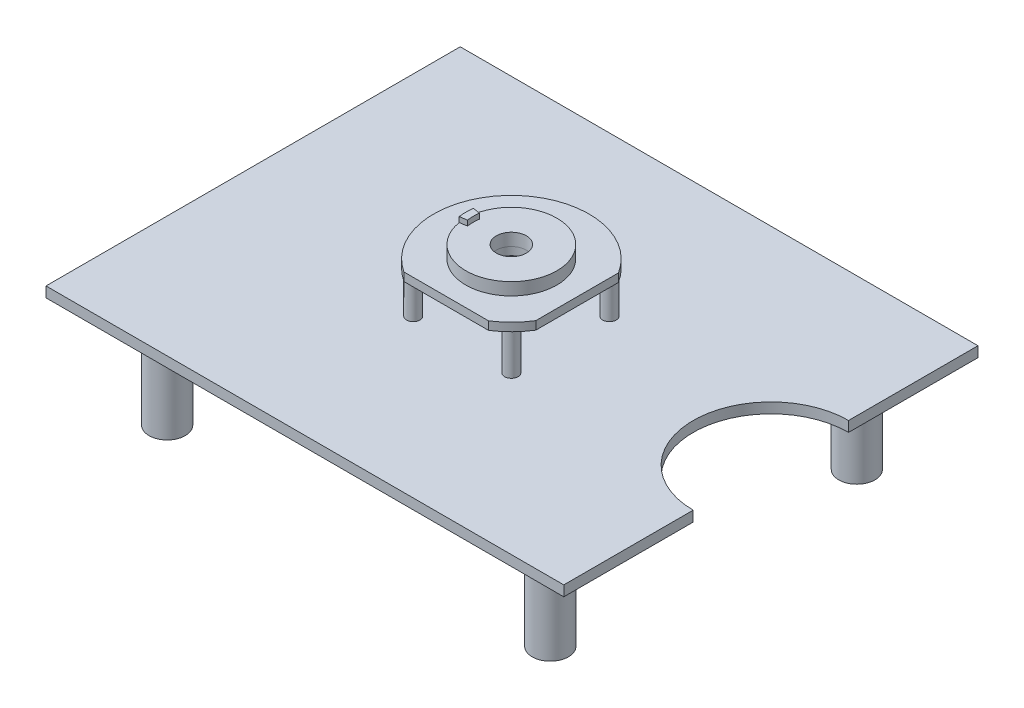
ISO-10303-21;
HEADER;
FILE_DESCRIPTION(('STEP AP214'),'2;1');
FILE_NAME('part.step','',(''),(''),'','','');
FILE_SCHEMA(('AUTOMOTIVE_DESIGN { 1 0 10303 214 1 1 1 1 }'));
ENDSEC;
DATA;
#1=APPLICATION_CONTEXT('core data for automotive mechanical design processes');
#2=APPLICATION_PROTOCOL_DEFINITION('international standard','automotive_design',2000,#1);
#3=PRODUCT_CONTEXT('',#1,'mechanical');
#4=PRODUCT('Part','Part','',(#3));
#5=PRODUCT_RELATED_PRODUCT_CATEGORY('part','',(#4));
#6=PRODUCT_DEFINITION_FORMATION('','',#4);
#7=PRODUCT_DEFINITION_CONTEXT('part definition',#1,'design');
#8=PRODUCT_DEFINITION('design','',#6,#7);
#9=PRODUCT_DEFINITION_SHAPE('','',#8);
#10=(LENGTH_UNIT() NAMED_UNIT(*) SI_UNIT(.MILLI.,.METRE.));
#11=(NAMED_UNIT(*) PLANE_ANGLE_UNIT() SI_UNIT($,.RADIAN.));
#12=(NAMED_UNIT(*) SI_UNIT($,.STERADIAN.) SOLID_ANGLE_UNIT());
#13=UNCERTAINTY_MEASURE_WITH_UNIT(LENGTH_MEASURE(1.E-05),#10,'distance_accuracy_value','');
#14=(GEOMETRIC_REPRESENTATION_CONTEXT(3) GLOBAL_UNCERTAINTY_ASSIGNED_CONTEXT((#13)) GLOBAL_UNIT_ASSIGNED_CONTEXT((#10,
#11,#12)) REPRESENTATION_CONTEXT('',''));
#15=CARTESIAN_POINT('',(0.,0.,0.));
#16=DIRECTION('',(0.,0.,1.));
#17=DIRECTION('',(1.,0.,0.));
#18=AXIS2_PLACEMENT_3D('',#15,#16,#17);
#19=CARTESIAN_POINT('',(250.,4.,-200.));
#20=DIRECTION('',(-1.,0.,0.));
#21=DIRECTION('',(0.,0.,1.));
#22=AXIS2_PLACEMENT_3D('',#19,#20,#21);
#23=PLANE('',#22);
#24=DIRECTION('',(0.,0.,-1.));
#25=VECTOR('',#24,1.);
#26=CARTESIAN_POINT('',(250.,0.,-200.));
#27=LINE('',#26,#25);
#28=CARTESIAN_POINT('',(250.,0.,200.));
#29=VERTEX_POINT('',#28);
#30=CARTESIAN_POINT('',(250.,0.,75.));
#31=VERTEX_POINT('',#30);
#32=EDGE_CURVE('E144',#29,#31,#27,.T.);
#33=ORIENTED_EDGE('',*,*,#32,.T.);
#34=DIRECTION('',(0.,1.,0.));
#35=VECTOR('',#34,1.);
#36=CARTESIAN_POINT('',(250.,-100.,75.));
#37=LINE('',#36,#35);
#38=CARTESIAN_POINT('',(250.,9.99999999999999,75.));
#39=VERTEX_POINT('',#38);
#40=EDGE_CURVE('E133',#31,#39,#37,.T.);
#41=ORIENTED_EDGE('',*,*,#40,.T.);
#42=DIRECTION('',(0.,0.,-1.));
#43=VECTOR('',#42,1.);
#44=CARTESIAN_POINT('',(250.,10.,200.));
#45=LINE('',#44,#43);
#46=CARTESIAN_POINT('',(250.,10.,200.));
#47=VERTEX_POINT('',#46);
#48=EDGE_CURVE('E142',#47,#39,#45,.T.);
#49=ORIENTED_EDGE('',*,*,#48,.F.);
#50=DIRECTION('',(0.,-1.,0.));
#51=VECTOR('',#50,1.);
#52=CARTESIAN_POINT('',(250.,4.,200.));
#53=LINE('',#52,#51);
#54=EDGE_CURVE('E192',#47,#29,#53,.T.);
#55=ORIENTED_EDGE('',*,*,#54,.T.);
#56=EDGE_LOOP('',(#33,#41,#49,#55));
#57=FACE_BOUND('',#56,.T.);
#58=ADVANCED_FACE('F34',(#57),#23,.F.);
#59=CARTESIAN_POINT('',(0.,50.,0.623845660501408));
#60=DIRECTION('',(0.,1.,0.));
#61=DIRECTION('',(-1.,0.,0.));
#62=AXIS2_PLACEMENT_3D('',#59,#60,#61);
#63=CYLINDRICAL_SURFACE('',#62,75.);
#64=CARTESIAN_POINT('',(0.,50.,0.623845660501408));
#65=DIRECTION('',(0.,-1.,0.));
#66=DIRECTION('',(1.,0.,0.));
#67=AXIS2_PLACEMENT_3D('',#64,#65,#66);
#68=CIRCLE('',#67,75.);
#69=CARTESIAN_POINT('',(63.5,50.,40.5331177661161));
#70=VERTEX_POINT('',#69);
#71=CARTESIAN_POINT('',(40.8850732599998,50.,63.5));
#72=VERTEX_POINT('',#71);
#73=EDGE_CURVE('E262',#70,#72,#68,.T.);
#74=ORIENTED_EDGE('',*,*,#73,.F.);
#75=DIRECTION('',(0.,1.,0.));
#76=VECTOR('',#75,1.);
#77=CARTESIAN_POINT('',(63.5,50.,40.5331177661161));
#78=LINE('',#77,#76);
#79=CARTESIAN_POINT('',(63.5,58.,40.5331177661161));
#80=VERTEX_POINT('',#79);
#81=EDGE_CURVE('E56',#70,#80,#78,.T.);
#82=ORIENTED_EDGE('',*,*,#81,.T.);
#83=CARTESIAN_POINT('',(0.,58.,0.623845660501408));
#84=DIRECTION('',(0.,-1.,0.));
#85=DIRECTION('',(1.,0.,0.));
#86=AXIS2_PLACEMENT_3D('',#83,#84,#85);
#87=CIRCLE('',#86,75.);
#88=CARTESIAN_POINT('',(40.8850732599998,58.,63.5));
#89=VERTEX_POINT('',#88);
#90=EDGE_CURVE('E261',#80,#89,#87,.T.);
#91=ORIENTED_EDGE('',*,*,#90,.T.);
#92=DIRECTION('',(0.,1.,0.));
#93=VECTOR('',#92,1.);
#94=CARTESIAN_POINT('',(40.8850732599998,50.,63.5));
#95=LINE('',#94,#93);
#96=EDGE_CURVE('E319',#89,#72,#95,.F.);
#97=ORIENTED_EDGE('',*,*,#96,.T.);
#98=EDGE_LOOP('',(#74,#82,#91,#97));
#99=FACE_BOUND('',#98,.T.);
#100=ADVANCED_FACE('F376',(#99),#63,.T.);
#101=CARTESIAN_POINT('',(14.5,58.,0.623845660501408));
#102=DIRECTION('',(0.,-1.,0.));
#103=DIRECTION('',(0.,0.,-1.));
#104=AXIS2_PLACEMENT_3D('',#101,#102,#103);
#105=PLANE('',#104);
#106=CARTESIAN_POINT('',(0.,58.,0.623845660501408));
#107=DIRECTION('',(0.,-1.,0.));
#108=DIRECTION('',(0.,0.,-1.));
#109=AXIS2_PLACEMENT_3D('',#106,#107,#108);
#110=CIRCLE('',#109,14.5);
#111=CARTESIAN_POINT('',(0.,58.,-13.8761543394986));
#112=VERTEX_POINT('',#111);
#113=EDGE_CURVE('E330',#112,#112,#110,.T.);
#114=ORIENTED_EDGE('',*,*,#113,.F.);
#115=EDGE_LOOP('',(#114));
#116=FACE_BOUND('',#115,.T.);
#117=CARTESIAN_POINT('',(0.,58.,0.623845660501408));
#118=DIRECTION('',(0.,1.,0.));
#119=DIRECTION('',(-1.,0.,0.));
#120=AXIS2_PLACEMENT_3D('',#117,#118,#119);
#121=CIRCLE('',#120,15.);
#122=CARTESIAN_POINT('',(-15.,58.,0.623845660501408));
#123=VERTEX_POINT('',#122);
#124=EDGE_CURVE('E241',#123,#123,#121,.T.);
#125=ORIENTED_EDGE('',*,*,#124,.F.);
#126=EDGE_LOOP('',(#125));
#127=FACE_BOUND('',#126,.T.);
#128=ADVANCED_FACE('F382',(#116,#127),#105,.T.);
#129=CARTESIAN_POINT('',(0.,58.,0.623845660501408));
#130=DIRECTION('',(0.,-1.,0.));
#131=DIRECTION('',(0.,0.,-1.));
#132=AXIS2_PLACEMENT_3D('',#129,#130,#131);
#133=CYLINDRICAL_SURFACE('',#132,44.);
#134=CARTESIAN_POINT('',(0.,70.,0.623845660501408));
#135=DIRECTION('',(0.,-1.,0.));
#136=DIRECTION('',(0.,0.,-1.));
#137=AXIS2_PLACEMENT_3D('',#134,#135,#136);
#138=CIRCLE('',#137,44.);
#139=CARTESIAN_POINT('',(-43.458286986186,70.,-6.25927080126876));
#140=VERTEX_POINT('',#139);
#141=CARTESIAN_POINT('',(-43.458286986186,70.,7.50696212227159));
#142=VERTEX_POINT('',#141);
#143=EDGE_CURVE('E224',#140,#142,#138,.T.);
#144=ORIENTED_EDGE('',*,*,#143,.T.);
#145=DIRECTION('',(0.,-1.,0.));
#146=VECTOR('',#145,1.);
#147=CARTESIAN_POINT('',(-43.458286986186,75.,7.50696212227159));
#148=LINE('',#147,#146);
#149=CARTESIAN_POINT('',(-43.458286986186,75.,7.50696212227159));
#150=VERTEX_POINT('',#149);
#151=EDGE_CURVE('E226',#150,#142,#148,.T.);
#152=ORIENTED_EDGE('',*,*,#151,.F.);
#153=CARTESIAN_POINT('',(0.,75.,0.623845660501408));
#154=DIRECTION('',(0.,1.,0.));
#155=DIRECTION('',(0.,0.,1.));
#156=AXIS2_PLACEMENT_3D('',#153,#154,#155);
#157=CIRCLE('',#156,44.);
#158=CARTESIAN_POINT('',(-43.458286986186,75.,-6.25927080126876));
#159=VERTEX_POINT('',#158);
#160=EDGE_CURVE('E204',#159,#150,#157,.T.);
#161=ORIENTED_EDGE('',*,*,#160,.F.);
#162=DIRECTION('',(0.,-1.,0.));
#163=VECTOR('',#162,1.);
#164=CARTESIAN_POINT('',(-43.458286986186,75.,-6.25927080126876));
#165=LINE('',#164,#163);
#166=EDGE_CURVE('E215',#159,#140,#165,.T.);
#167=ORIENTED_EDGE('',*,*,#166,.T.);
#168=EDGE_LOOP('',(#144,#152,#161,#167));
#169=FACE_BOUND('',#168,.T.);
#170=CARTESIAN_POINT('',(0.,58.,0.623845660501408));
#171=DIRECTION('',(0.,-1.,0.));
#172=DIRECTION('',(0.,0.,-1.));
#173=AXIS2_PLACEMENT_3D('',#170,#171,#172);
#174=CIRCLE('',#173,44.);
#175=CARTESIAN_POINT('',(0.,58.,-43.3761543394986));
#176=VERTEX_POINT('',#175);
#177=EDGE_CURVE('E326',#176,#176,#174,.T.);
#178=ORIENTED_EDGE('',*,*,#177,.F.);
#179=EDGE_LOOP('',(#178));
#180=FACE_BOUND('',#179,.T.);
#181=ADVANCED_FACE('F36',(#169,#180),#133,.T.);
#182=CARTESIAN_POINT('',(0.,58.,0.623845660501408));
#183=DIRECTION('',(0.,-1.,0.));
#184=DIRECTION('',(0.,0.,-1.));
#185=AXIS2_PLACEMENT_3D('',#182,#183,#184);
#186=CYLINDRICAL_SURFACE('',#185,14.5);
#187=ORIENTED_EDGE('',*,*,#113,.T.);
#188=EDGE_LOOP('',(#187));
#189=FACE_BOUND('',#188,.T.);
#190=CARTESIAN_POINT('',(0.,70.,0.623845660501408));
#191=DIRECTION('',(0.,-1.,0.));
#192=DIRECTION('',(0.,0.,-1.));
#193=AXIS2_PLACEMENT_3D('',#190,#191,#192);
#194=CIRCLE('',#193,14.5);
#195=CARTESIAN_POINT('',(0.,70.,-13.8761543394986));
#196=VERTEX_POINT('',#195);
#197=EDGE_CURVE('E335',#196,#196,#194,.T.);
#198=ORIENTED_EDGE('',*,*,#197,.F.);
#199=EDGE_LOOP('',(#198));
#200=FACE_BOUND('',#199,.T.);
#201=ADVANCED_FACE('F373',(#189,#200),#186,.F.);
#202=CARTESIAN_POINT('',(14.5,70.,0.623845660501408));
#203=DIRECTION('',(0.,1.,0.));
#204=DIRECTION('',(0.,0.,1.));
#205=AXIS2_PLACEMENT_3D('',#202,#203,#204);
#206=PLANE('',#205);
#207=DIRECTION('',(-0.987688340595138,0.,-0.156434465040231));
#208=VECTOR('',#207,1.);
#209=CARTESIAN_POINT('',(0.,70.,0.623845660501408));
#210=LINE('',#209,#208);
#211=CARTESIAN_POINT('',(-36.5444686020201,70.,-5.16422954598714));
#212=VERTEX_POINT('',#211);
#213=EDGE_CURVE('E207',#212,#140,#210,.T.);
#214=ORIENTED_EDGE('',*,*,#213,.F.);
#215=CARTESIAN_POINT('',(0.,70.,0.623845660501408));
#216=DIRECTION('',(0.,1.,0.));
#217=DIRECTION('',(0.,0.,1.));
#218=AXIS2_PLACEMENT_3D('',#215,#216,#217);
#219=CIRCLE('',#218,37.);
#220=CARTESIAN_POINT('',(-36.5444686020201,70.,6.41192086698997));
#221=VERTEX_POINT('',#220);
#222=EDGE_CURVE('E218',#212,#221,#219,.T.);
#223=ORIENTED_EDGE('',*,*,#222,.T.);
#224=DIRECTION('',(-0.987688340595138,0.,0.156434465040232));
#225=VECTOR('',#224,1.);
#226=CARTESIAN_POINT('',(0.,70.,0.623845660501408));
#227=LINE('',#226,#225);
#228=EDGE_CURVE('E203',#221,#142,#227,.T.);
#229=ORIENTED_EDGE('',*,*,#228,.T.);
#230=ORIENTED_EDGE('',*,*,#143,.F.);
#231=EDGE_LOOP('',(#214,#223,#229,#230));
#232=FACE_BOUND('',#231,.T.);
#233=ORIENTED_EDGE('',*,*,#197,.T.);
#234=EDGE_LOOP('',(#233));
#235=FACE_BOUND('',#234,.T.);
#236=ADVANCED_FACE('F354',(#232,#235),#206,.T.);
#237=CARTESIAN_POINT('',(0.,75.,0.623845660501408));
#238=DIRECTION('',(0.156434465040232,0.,0.987688340595138));
#239=DIRECTION('',(0.987688340595138,0.,-0.156434465040232));
#240=AXIS2_PLACEMENT_3D('',#237,#238,#239);
#241=PLANE('',#240);
#242=ORIENTED_EDGE('',*,*,#228,.F.);
#243=DIRECTION('',(0.,-1.,0.));
#244=VECTOR('',#243,1.);
#245=CARTESIAN_POINT('',(-36.5444686020201,75.,6.41192086698997));
#246=LINE('',#245,#244);
#247=CARTESIAN_POINT('',(-36.5444686020201,75.,6.41192086698997));
#248=VERTEX_POINT('',#247);
#249=EDGE_CURVE('E228',#248,#221,#246,.T.);
#250=ORIENTED_EDGE('',*,*,#249,.F.);
#251=DIRECTION('',(-0.987688340595138,0.,0.156434465040232));
#252=VECTOR('',#251,1.);
#253=CARTESIAN_POINT('',(0.,75.,0.623845660501408));
#254=LINE('',#253,#252);
#255=EDGE_CURVE('E206',#248,#150,#254,.T.);
#256=ORIENTED_EDGE('',*,*,#255,.T.);
#257=ORIENTED_EDGE('',*,*,#151,.T.);
#258=EDGE_LOOP('',(#242,#250,#256,#257));
#259=FACE_BOUND('',#258,.T.);
#260=ADVANCED_FACE('F365',(#259),#241,.T.);
#261=CARTESIAN_POINT('',(0.,75.,0.623845660501408));
#262=DIRECTION('',(0.,-1.,0.));
#263=DIRECTION('',(0.,0.,-1.));
#264=AXIS2_PLACEMENT_3D('',#261,#262,#263);
#265=CYLINDRICAL_SURFACE('',#264,37.);
#266=ORIENTED_EDGE('',*,*,#222,.F.);
#267=DIRECTION('',(0.,-1.,0.));
#268=VECTOR('',#267,1.);
#269=CARTESIAN_POINT('',(-36.5444686020201,75.,-5.16422954598714));
#270=LINE('',#269,#268);
#271=CARTESIAN_POINT('',(-36.5444686020201,75.,-5.16422954598714));
#272=VERTEX_POINT('',#271);
#273=EDGE_CURVE('E236',#272,#212,#270,.T.);
#274=ORIENTED_EDGE('',*,*,#273,.F.);
#275=CARTESIAN_POINT('',(0.,75.,0.623845660501408));
#276=DIRECTION('',(0.,1.,0.));
#277=DIRECTION('',(0.,0.,1.));
#278=AXIS2_PLACEMENT_3D('',#275,#276,#277);
#279=CIRCLE('',#278,37.);
#280=EDGE_CURVE('E210',#272,#248,#279,.T.);
#281=ORIENTED_EDGE('',*,*,#280,.T.);
#282=ORIENTED_EDGE('',*,*,#249,.T.);
#283=EDGE_LOOP('',(#266,#274,#281,#282));
#284=FACE_BOUND('',#283,.T.);
#285=ADVANCED_FACE('F350',(#284),#265,.F.);
#286=CARTESIAN_POINT('',(0.,75.,0.623845660501408));
#287=DIRECTION('',(-0.156434465040231,0.,0.987688340595138));
#288=DIRECTION('',(0.987688340595138,0.,0.156434465040231));
#289=AXIS2_PLACEMENT_3D('',#286,#287,#288);
#290=PLANE('',#289);
#291=ORIENTED_EDGE('',*,*,#213,.T.);
#292=ORIENTED_EDGE('',*,*,#166,.F.);
#293=DIRECTION('',(-0.987688340595138,0.,-0.156434465040231));
#294=VECTOR('',#293,1.);
#295=CARTESIAN_POINT('',(0.,75.,0.623845660501408));
#296=LINE('',#295,#294);
#297=EDGE_CURVE('E213',#272,#159,#296,.T.);
#298=ORIENTED_EDGE('',*,*,#297,.F.);
#299=ORIENTED_EDGE('',*,*,#273,.T.);
#300=EDGE_LOOP('',(#291,#292,#298,#299));
#301=FACE_BOUND('',#300,.T.);
#302=ADVANCED_FACE('F344',(#301),#290,.F.);
#303=CARTESIAN_POINT('',(0.,75.,0.623845660501408));
#304=DIRECTION('',(0.,1.,0.));
#305=DIRECTION('',(0.,0.,1.));
#306=AXIS2_PLACEMENT_3D('',#303,#304,#305);
#307=PLANE('',#306);
#308=ORIENTED_EDGE('',*,*,#160,.T.);
#309=ORIENTED_EDGE('',*,*,#255,.F.);
#310=ORIENTED_EDGE('',*,*,#280,.F.);
#311=ORIENTED_EDGE('',*,*,#297,.T.);
#312=EDGE_LOOP('',(#308,#309,#310,#311));
#313=FACE_BOUND('',#312,.T.);
#314=ADVANCED_FACE('F363',(#313),#307,.T.);
#315=CARTESIAN_POINT('',(0.,58.,0.623845660501408));
#316=DIRECTION('',(0.,-1.,0.));
#317=DIRECTION('',(1.,0.,0.));
#318=AXIS2_PLACEMENT_3D('',#315,#316,#317);
#319=PLANE('',#318);
#320=ORIENTED_EDGE('',*,*,#90,.F.);
#321=DIRECTION('',(0.,0.,1.));
#322=VECTOR('',#321,1.);
#323=CARTESIAN_POINT('',(63.5,58.,-50.8));
#324=LINE('',#323,#322);
#325=CARTESIAN_POINT('',(63.5,58.,-39.2854264451133));
#326=VERTEX_POINT('',#325);
#327=EDGE_CURVE('E145',#326,#80,#324,.T.);
#328=ORIENTED_EDGE('',*,*,#327,.F.);
#329=CARTESIAN_POINT('',(-40.8850732599998,58.,63.5));
#330=VERTEX_POINT('',#329);
#331=EDGE_CURVE('E256',#330,#326,#87,.T.);
#332=ORIENTED_EDGE('',*,*,#331,.F.);
#333=DIRECTION('',(-1.,0.,0.));
#334=VECTOR('',#333,1.);
#335=CARTESIAN_POINT('',(-50.8,58.,63.5));
#336=LINE('',#335,#334);
#337=EDGE_CURVE('E317',#89,#330,#336,.T.);
#338=ORIENTED_EDGE('',*,*,#337,.F.);
#339=EDGE_LOOP('',(#320,#328,#332,#338));
#340=FACE_BOUND('',#339,.T.);
#341=ORIENTED_EDGE('',*,*,#177,.T.);
#342=EDGE_LOOP('',(#341));
#343=FACE_BOUND('',#342,.T.);
#344=ADVANCED_FACE('F403',(#340,#343),#319,.F.);
#345=CARTESIAN_POINT('',(0.,0.,0.));
#346=DIRECTION('',(0.,-1.,0.));
#347=DIRECTION('',(0.,0.,-1.));
#348=AXIS2_PLACEMENT_3D('',#345,#346,#347);
#349=PLANE('',#348);
#350=CARTESIAN_POINT('',(250.,0.,0.));
#351=DIRECTION('',(0.,-1.,0.));
#352=DIRECTION('',(0.,0.,-1.));
#353=AXIS2_PLACEMENT_3D('',#350,#351,#352);
#354=CIRCLE('',#353,75.);
#355=CARTESIAN_POINT('',(250.,0.,-75.));
#356=VERTEX_POINT('',#355);
#357=EDGE_CURVE('E146',#31,#356,#354,.T.);
#358=ORIENTED_EDGE('',*,*,#357,.F.);
#359=ORIENTED_EDGE('',*,*,#32,.F.);
#360=DIRECTION('',(1.,0.,0.));
#361=VECTOR('',#360,1.);
#362=CARTESIAN_POINT('',(250.,0.,200.));
#363=LINE('',#362,#361);
#364=CARTESIAN_POINT('',(-250.,0.,200.));
#365=VERTEX_POINT('',#364);
#366=EDGE_CURVE('E180',#365,#29,#363,.T.);
#367=ORIENTED_EDGE('',*,*,#366,.F.);
#368=DIRECTION('',(0.,0.,1.));
#369=VECTOR('',#368,1.);
#370=CARTESIAN_POINT('',(-250.,0.,-200.));
#371=LINE('',#370,#369);
#372=CARTESIAN_POINT('',(-250.,0.,-200.));
#373=VERTEX_POINT('',#372);
#374=EDGE_CURVE('E175',#373,#365,#371,.T.);
#375=ORIENTED_EDGE('',*,*,#374,.F.);
#376=DIRECTION('',(-1.,0.,0.));
#377=VECTOR('',#376,1.);
#378=CARTESIAN_POINT('',(250.,0.,-200.));
#379=LINE('',#378,#377);
#380=CARTESIAN_POINT('',(250.,0.,-200.));
#381=VERTEX_POINT('',#380);
#382=EDGE_CURVE('E184',#381,#373,#379,.T.);
#383=ORIENTED_EDGE('',*,*,#382,.F.);
#384=EDGE_CURVE('E182',#356,#381,#27,.T.);
#385=ORIENTED_EDGE('',*,*,#384,.F.);
#386=EDGE_LOOP('',(#358,#359,#367,#375,#383,#385));
#387=FACE_BOUND('',#386,.T.);
#388=CARTESIAN_POINT('',(0.,0.,0.));
#389=DIRECTION('',(0.,-1.,0.));
#390=DIRECTION('',(0.,0.,-1.));
#391=AXIS2_PLACEMENT_3D('',#388,#389,#390);
#392=CIRCLE('',#391,10.);
#393=CARTESIAN_POINT('',(0.,0.,-10.));
#394=VERTEX_POINT('',#393);
#395=EDGE_CURVE('E295',#394,#394,#392,.T.);
#396=ORIENTED_EDGE('',*,*,#395,.F.);
#397=EDGE_LOOP('',(#396));
#398=FACE_BOUND('',#397,.T.);
#399=CARTESIAN_POINT('',(-185.,0.,148.));
#400=DIRECTION('',(0.,-1.,0.));
#401=DIRECTION('',(0.,0.,-1.));
#402=AXIS2_PLACEMENT_3D('',#399,#400,#401);
#403=CIRCLE('',#402,17.5);
#404=CARTESIAN_POINT('',(-185.,0.,130.5));
#405=VERTEX_POINT('',#404);
#406=EDGE_CURVE('E200',#405,#405,#403,.T.);
#407=ORIENTED_EDGE('',*,*,#406,.F.);
#408=EDGE_LOOP('',(#407));
#409=FACE_BOUND('',#408,.T.);
#410=CARTESIAN_POINT('',(-185.,0.,-148.));
#411=DIRECTION('',(0.,-1.,0.));
#412=DIRECTION('',(0.,0.,-1.));
#413=AXIS2_PLACEMENT_3D('',#410,#411,#412);
#414=CIRCLE('',#413,17.5);
#415=CARTESIAN_POINT('',(-185.,0.,-165.5));
#416=VERTEX_POINT('',#415);
#417=EDGE_CURVE('E171',#416,#416,#414,.T.);
#418=ORIENTED_EDGE('',*,*,#417,.F.);
#419=EDGE_LOOP('',(#418));
#420=FACE_BOUND('',#419,.T.);
#421=CARTESIAN_POINT('',(185.,0.,-148.));
#422=DIRECTION('',(0.,-1.,0.));
#423=DIRECTION('',(0.,0.,-1.));
#424=AXIS2_PLACEMENT_3D('',#421,#422,#423);
#425=CIRCLE('',#424,17.5);
#426=CARTESIAN_POINT('',(185.,0.,-165.5));
#427=VERTEX_POINT('',#426);
#428=EDGE_CURVE('E197',#427,#427,#425,.T.);
#429=ORIENTED_EDGE('',*,*,#428,.F.);
#430=EDGE_LOOP('',(#429));
#431=FACE_BOUND('',#430,.T.);
#432=CARTESIAN_POINT('',(185.,0.,148.));
#433=DIRECTION('',(0.,-1.,0.));
#434=DIRECTION('',(0.,0.,1.));
#435=AXIS2_PLACEMENT_3D('',#432,#433,#434);
#436=CIRCLE('',#435,17.5);
#437=CARTESIAN_POINT('',(185.,0.,165.5));
#438=VERTEX_POINT('',#437);
#439=EDGE_CURVE('E158',#438,#438,#436,.T.);
#440=ORIENTED_EDGE('',*,*,#439,.F.);
#441=EDGE_LOOP('',(#440));
#442=FACE_BOUND('',#441,.T.);
#443=ADVANCED_FACE('F307',(#387,#398,#409,#420,#431,#442),#349,.T.);
#444=CARTESIAN_POINT('',(-250.,4.,-200.));
#445=DIRECTION('',(1.,0.,0.));
#446=DIRECTION('',(0.,0.,-1.));
#447=AXIS2_PLACEMENT_3D('',#444,#445,#446);
#448=PLANE('',#447);
#449=ORIENTED_EDGE('',*,*,#374,.T.);
#450=DIRECTION('',(0.,-1.,0.));
#451=VECTOR('',#450,1.);
#452=CARTESIAN_POINT('',(-250.,4.,200.));
#453=LINE('',#452,#451);
#454=CARTESIAN_POINT('',(-250.,10.,200.));
#455=VERTEX_POINT('',#454);
#456=EDGE_CURVE('E194',#455,#365,#453,.T.);
#457=ORIENTED_EDGE('',*,*,#456,.F.);
#458=DIRECTION('',(0.,0.,1.));
#459=VECTOR('',#458,1.);
#460=CARTESIAN_POINT('',(-250.,10.,-200.));
#461=LINE('',#460,#459);
#462=CARTESIAN_POINT('',(-250.,10.,-200.));
#463=VERTEX_POINT('',#462);
#464=EDGE_CURVE('E300',#463,#455,#461,.T.);
#465=ORIENTED_EDGE('',*,*,#464,.F.);
#466=DIRECTION('',(0.,-1.,0.));
#467=VECTOR('',#466,1.);
#468=CARTESIAN_POINT('',(-250.,4.,-200.));
#469=LINE('',#468,#467);
#470=EDGE_CURVE('E186',#463,#373,#469,.T.);
#471=ORIENTED_EDGE('',*,*,#470,.T.);
#472=EDGE_LOOP('',(#449,#457,#465,#471));
#473=FACE_BOUND('',#472,.T.);
#474=ADVANCED_FACE('F396',(#473),#448,.F.);
#475=CARTESIAN_POINT('',(250.,4.,200.));
#476=DIRECTION('',(0.,0.,-1.));
#477=DIRECTION('',(-1.,0.,0.));
#478=AXIS2_PLACEMENT_3D('',#475,#476,#477);
#479=PLANE('',#478);
#480=ORIENTED_EDGE('',*,*,#366,.T.);
#481=ORIENTED_EDGE('',*,*,#54,.F.);
#482=DIRECTION('',(1.,0.,0.));
#483=VECTOR('',#482,1.);
#484=CARTESIAN_POINT('',(-250.,10.,200.));
#485=LINE('',#484,#483);
#486=EDGE_CURVE('E153',#455,#47,#485,.T.);
#487=ORIENTED_EDGE('',*,*,#486,.F.);
#488=ORIENTED_EDGE('',*,*,#456,.T.);
#489=EDGE_LOOP('',(#480,#481,#487,#488));
#490=FACE_BOUND('',#489,.T.);
#491=ADVANCED_FACE('F305',(#490),#479,.F.);
#492=CARTESIAN_POINT('',(250.,10.,-75.));
#493=VERTEX_POINT('',#492);
#494=CARTESIAN_POINT('',(250.,10.,-200.));
#495=VERTEX_POINT('',#494);
#496=EDGE_CURVE('E155',#493,#495,#45,.T.);
#497=ORIENTED_EDGE('',*,*,#496,.F.);
#498=DIRECTION('',(0.,1.,0.));
#499=VECTOR('',#498,1.);
#500=CARTESIAN_POINT('',(250.,-100.,-75.));
#501=LINE('',#500,#499);
#502=EDGE_CURVE('E48',#493,#356,#501,.F.);
#503=ORIENTED_EDGE('',*,*,#502,.T.);
#504=ORIENTED_EDGE('',*,*,#384,.T.);
#505=DIRECTION('',(0.,-1.,0.));
#506=VECTOR('',#505,1.);
#507=CARTESIAN_POINT('',(250.,4.,-200.));
#508=LINE('',#507,#506);
#509=EDGE_CURVE('E189',#495,#381,#508,.T.);
#510=ORIENTED_EDGE('',*,*,#509,.F.);
#511=EDGE_LOOP('',(#497,#503,#504,#510));
#512=FACE_BOUND('',#511,.T.);
#513=ADVANCED_FACE('F378',(#512),#23,.F.);
#514=CARTESIAN_POINT('',(250.,4.,-200.));
#515=DIRECTION('',(0.,0.,1.));
#516=DIRECTION('',(1.,0.,0.));
#517=AXIS2_PLACEMENT_3D('',#514,#515,#516);
#518=PLANE('',#517);
#519=ORIENTED_EDGE('',*,*,#382,.T.);
#520=ORIENTED_EDGE('',*,*,#470,.F.);
#521=DIRECTION('',(-1.,0.,0.));
#522=VECTOR('',#521,1.);
#523=CARTESIAN_POINT('',(250.,10.,-200.));
#524=LINE('',#523,#522);
#525=EDGE_CURVE('E298',#495,#463,#524,.T.);
#526=ORIENTED_EDGE('',*,*,#525,.F.);
#527=ORIENTED_EDGE('',*,*,#509,.T.);
#528=EDGE_LOOP('',(#519,#520,#526,#527));
#529=FACE_BOUND('',#528,.T.);
#530=ADVANCED_FACE('F388',(#529),#518,.F.);
#531=CARTESIAN_POINT('',(-185.,-100.,-148.));
#532=DIRECTION('',(0.,1.,0.));
#533=DIRECTION('',(0.,0.,1.));
#534=AXIS2_PLACEMENT_3D('',#531,#532,#533);
#535=CYLINDRICAL_SURFACE('',#534,17.5);
#536=CARTESIAN_POINT('',(-185.,-100.,-148.));
#537=DIRECTION('',(0.,-1.,0.));
#538=DIRECTION('',(0.,0.,-1.));
#539=AXIS2_PLACEMENT_3D('',#536,#537,#538);
#540=CIRCLE('',#539,17.5);
#541=CARTESIAN_POINT('',(-185.,-100.,-165.5));
#542=VERTEX_POINT('',#541);
#543=EDGE_CURVE('E172',#542,#542,#540,.T.);
#544=ORIENTED_EDGE('',*,*,#543,.F.);
#545=EDGE_LOOP('',(#544));
#546=FACE_BOUND('',#545,.T.);
#547=ORIENTED_EDGE('',*,*,#417,.T.);
#548=EDGE_LOOP('',(#547));
#549=FACE_BOUND('',#548,.T.);
#550=ADVANCED_FACE('F394',(#546,#549),#535,.T.);
#551=CARTESIAN_POINT('',(-185.,-100.,-148.));
#552=DIRECTION('',(0.,-1.,0.));
#553=DIRECTION('',(0.,0.,-1.));
#554=AXIS2_PLACEMENT_3D('',#551,#552,#553);
#555=PLANE('',#554);
#556=ORIENTED_EDGE('',*,*,#543,.T.);
#557=EDGE_LOOP('',(#556));
#558=FACE_BOUND('',#557,.T.);
#559=ADVANCED_FACE('F590',(#558),#555,.T.);
#560=CARTESIAN_POINT('',(185.,-100.,-148.));
#561=DIRECTION('',(0.,1.,0.));
#562=DIRECTION('',(0.,0.,1.));
#563=AXIS2_PLACEMENT_3D('',#560,#561,#562);
#564=CYLINDRICAL_SURFACE('',#563,17.5);
#565=CARTESIAN_POINT('',(185.,-100.,-148.));
#566=DIRECTION('',(0.,1.,0.));
#567=DIRECTION('',(0.,0.,-1.));
#568=AXIS2_PLACEMENT_3D('',#565,#566,#567);
#569=CIRCLE('',#568,17.5);
#570=CARTESIAN_POINT('',(185.,-100.,-165.5));
#571=VERTEX_POINT('',#570);
#572=EDGE_CURVE('E166',#571,#571,#569,.T.);
#573=ORIENTED_EDGE('',*,*,#572,.T.);
#574=EDGE_LOOP('',(#573));
#575=FACE_BOUND('',#574,.T.);
#576=ORIENTED_EDGE('',*,*,#428,.T.);
#577=EDGE_LOOP('',(#576));
#578=FACE_BOUND('',#577,.T.);
#579=ADVANCED_FACE('F580',(#575,#578),#564,.T.);
#580=CARTESIAN_POINT('',(185.,-100.,-148.));
#581=DIRECTION('',(0.,-1.,0.));
#582=DIRECTION('',(0.,0.,-1.));
#583=AXIS2_PLACEMENT_3D('',#580,#581,#582);
#584=PLANE('',#583);
#585=ORIENTED_EDGE('',*,*,#572,.F.);
#586=EDGE_LOOP('',(#585));
#587=FACE_BOUND('',#586,.T.);
#588=ADVANCED_FACE('F570',(#587),#584,.T.);
#589=CARTESIAN_POINT('',(185.,-100.,148.));
#590=DIRECTION('',(0.,1.,0.));
#591=DIRECTION('',(0.,0.,1.));
#592=AXIS2_PLACEMENT_3D('',#589,#590,#591);
#593=CYLINDRICAL_SURFACE('',#592,17.5);
#594=CARTESIAN_POINT('',(185.,-100.,148.));
#595=DIRECTION('',(0.,-1.,0.));
#596=DIRECTION('',(0.,0.,1.));
#597=AXIS2_PLACEMENT_3D('',#594,#595,#596);
#598=CIRCLE('',#597,17.5);
#599=CARTESIAN_POINT('',(185.,-100.,165.5));
#600=VERTEX_POINT('',#599);
#601=EDGE_CURVE('E163',#600,#600,#598,.T.);
#602=ORIENTED_EDGE('',*,*,#601,.F.);
#603=EDGE_LOOP('',(#602));
#604=FACE_BOUND('',#603,.T.);
#605=ORIENTED_EDGE('',*,*,#439,.T.);
#606=EDGE_LOOP('',(#605));
#607=FACE_BOUND('',#606,.T.);
#608=ADVANCED_FACE('F560',(#604,#607),#593,.T.);
#609=CARTESIAN_POINT('',(185.,-100.,148.));
#610=DIRECTION('',(0.,-1.,0.));
#611=DIRECTION('',(0.,0.,1.));
#612=AXIS2_PLACEMENT_3D('',#609,#610,#611);
#613=PLANE('',#612);
#614=ORIENTED_EDGE('',*,*,#601,.T.);
#615=EDGE_LOOP('',(#614));
#616=FACE_BOUND('',#615,.T.);
#617=ADVANCED_FACE('F550',(#616),#613,.T.);
#618=CARTESIAN_POINT('',(-185.,-100.,148.));
#619=DIRECTION('',(0.,1.,0.));
#620=DIRECTION('',(0.,0.,1.));
#621=AXIS2_PLACEMENT_3D('',#618,#619,#620);
#622=CYLINDRICAL_SURFACE('',#621,17.5);
#623=CARTESIAN_POINT('',(-185.,-100.,148.));
#624=DIRECTION('',(0.,1.,0.));
#625=DIRECTION('',(0.,0.,1.));
#626=AXIS2_PLACEMENT_3D('',#623,#624,#625);
#627=CIRCLE('',#626,17.5);
#628=CARTESIAN_POINT('',(-185.,-100.,165.5));
#629=VERTEX_POINT('',#628);
#630=EDGE_CURVE('E154',#629,#629,#627,.T.);
#631=ORIENTED_EDGE('',*,*,#630,.T.);
#632=EDGE_LOOP('',(#631));
#633=FACE_BOUND('',#632,.T.);
#634=ORIENTED_EDGE('',*,*,#406,.T.);
#635=EDGE_LOOP('',(#634));
#636=FACE_BOUND('',#635,.T.);
#637=ADVANCED_FACE('F540',(#633,#636),#622,.T.);
#638=CARTESIAN_POINT('',(-185.,-100.,148.));
#639=DIRECTION('',(0.,-1.,0.));
#640=DIRECTION('',(0.,0.,1.));
#641=AXIS2_PLACEMENT_3D('',#638,#639,#640);
#642=PLANE('',#641);
#643=ORIENTED_EDGE('',*,*,#630,.F.);
#644=EDGE_LOOP('',(#643));
#645=FACE_BOUND('',#644,.T.);
#646=ADVANCED_FACE('F451',(#645),#642,.T.);
#647=CARTESIAN_POINT('',(0.,10.,0.));
#648=DIRECTION('',(0.,1.,0.));
#649=DIRECTION('',(0.,0.,1.));
#650=AXIS2_PLACEMENT_3D('',#647,#648,#649);
#651=PLANE('',#650);
#652=CARTESIAN_POINT('',(250.,9.99999999999999,0.));
#653=DIRECTION('',(0.,1.,0.));
#654=DIRECTION('',(0.,0.,1.));
#655=AXIS2_PLACEMENT_3D('',#652,#653,#654);
#656=CIRCLE('',#655,75.);
#657=EDGE_CURVE('E11',#493,#39,#656,.T.);
#658=ORIENTED_EDGE('',*,*,#657,.F.);
#659=ORIENTED_EDGE('',*,*,#496,.T.);
#660=ORIENTED_EDGE('',*,*,#525,.T.);
#661=ORIENTED_EDGE('',*,*,#464,.T.);
#662=ORIENTED_EDGE('',*,*,#486,.T.);
#663=ORIENTED_EDGE('',*,*,#48,.T.);
#664=EDGE_LOOP('',(#658,#659,#660,#661,#662,#663));
#665=FACE_BOUND('',#664,.T.);
#666=CARTESIAN_POINT('',(47.3761543394981,10.,48.0000000000007));
#667=DIRECTION('',(0.,-1.,0.));
#668=DIRECTION('',(0.,0.,-1.));
#669=AXIS2_PLACEMENT_3D('',#666,#667,#668);
#670=CIRCLE('',#669,6.5);
#671=CARTESIAN_POINT('',(47.3761543394982,10.,41.5000000000007));
#672=VERTEX_POINT('',#671);
#673=EDGE_CURVE('E289',#672,#672,#670,.T.);
#674=ORIENTED_EDGE('',*,*,#673,.T.);
#675=EDGE_LOOP('',(#674));
#676=FACE_BOUND('',#675,.T.);
#677=CARTESIAN_POINT('',(47.3761543394988,10.,-46.7523086789972));
#678=DIRECTION('',(0.,-1.,0.));
#679=DIRECTION('',(-1.,0.,0.));
#680=AXIS2_PLACEMENT_3D('',#677,#678,#679);
#681=CIRCLE('',#680,6.5);
#682=CARTESIAN_POINT('',(40.8761543394988,10.,-46.7523086789972));
#683=VERTEX_POINT('',#682);
#684=EDGE_CURVE('E286',#683,#683,#681,.T.);
#685=ORIENTED_EDGE('',*,*,#684,.T.);
#686=EDGE_LOOP('',(#685));
#687=FACE_BOUND('',#686,.T.);
#688=CARTESIAN_POINT('',(-47.3761543394984,10.,-46.7523086789975));
#689=DIRECTION('',(0.,-1.,0.));
#690=DIRECTION('',(0.,0.,1.));
#691=AXIS2_PLACEMENT_3D('',#688,#689,#690);
#692=CIRCLE('',#691,6.5);
#693=CARTESIAN_POINT('',(-47.3761543394984,10.,-40.2523086789975));
#694=VERTEX_POINT('',#693);
#695=EDGE_CURVE('E280',#694,#694,#692,.T.);
#696=ORIENTED_EDGE('',*,*,#695,.T.);
#697=EDGE_LOOP('',(#696));
#698=FACE_BOUND('',#697,.T.);
#699=CARTESIAN_POINT('',(-47.3761543394988,10.,48.));
#700=DIRECTION('',(0.,-1.,0.));
#701=DIRECTION('',(1.,0.,0.));
#702=AXIS2_PLACEMENT_3D('',#699,#700,#701);
#703=CIRCLE('',#702,6.5);
#704=CARTESIAN_POINT('',(-40.8761543394988,10.,48.));
#705=VERTEX_POINT('',#704);
#706=EDGE_CURVE('E283',#705,#705,#703,.T.);
#707=ORIENTED_EDGE('',*,*,#706,.T.);
#708=EDGE_LOOP('',(#707));
#709=FACE_BOUND('',#708,.T.);
#710=CARTESIAN_POINT('',(0.,10.,0.));
#711=DIRECTION('',(0.,1.,0.));
#712=DIRECTION('',(0.,0.,1.));
#713=AXIS2_PLACEMENT_3D('',#710,#711,#712);
#714=CIRCLE('',#713,10.);
#715=CARTESIAN_POINT('',(0.,10.,10.));
#716=VERTEX_POINT('',#715);
#717=EDGE_CURVE('E292',#716,#716,#714,.T.);
#718=ORIENTED_EDGE('',*,*,#717,.F.);
#719=EDGE_LOOP('',(#718));
#720=FACE_BOUND('',#719,.T.);
#721=ADVANCED_FACE('F149',(#665,#676,#687,#698,#709,#720),#651,.T.);
#722=CARTESIAN_POINT('',(0.,-100.,0.));
#723=DIRECTION('',(0.,1.,0.));
#724=DIRECTION('',(0.,0.,1.));
#725=AXIS2_PLACEMENT_3D('',#722,#723,#724);
#726=CYLINDRICAL_SURFACE('',#725,10.);
#727=ORIENTED_EDGE('',*,*,#395,.T.);
#728=EDGE_LOOP('',(#727));
#729=FACE_BOUND('',#728,.T.);
#730=ORIENTED_EDGE('',*,*,#717,.T.);
#731=EDGE_LOOP('',(#730));
#732=FACE_BOUND('',#731,.T.);
#733=ADVANCED_FACE('F450',(#729,#732),#726,.F.);
#734=CARTESIAN_POINT('',(47.3761543394981,10.,48.0000000000007));
#735=DIRECTION('',(0.,1.,0.));
#736=DIRECTION('',(-1.,0.,0.));
#737=AXIS2_PLACEMENT_3D('',#734,#735,#736);
#738=CYLINDRICAL_SURFACE('',#737,6.5);
#739=ORIENTED_EDGE('',*,*,#673,.F.);
#740=EDGE_LOOP('',(#739));
#741=FACE_BOUND('',#740,.T.);
#742=CARTESIAN_POINT('',(47.3761543394981,50.,48.0000000000007));
#743=DIRECTION('',(0.,-1.,0.));
#744=DIRECTION('',(0.,0.,-1.));
#745=AXIS2_PLACEMENT_3D('',#742,#743,#744);
#746=CIRCLE('',#745,6.5);
#747=CARTESIAN_POINT('',(47.3761543394982,50.,41.5000000000007));
#748=VERTEX_POINT('',#747);
#749=EDGE_CURVE('E277',#748,#748,#746,.T.);
#750=ORIENTED_EDGE('',*,*,#749,.T.);
#751=EDGE_LOOP('',(#750));
#752=FACE_BOUND('',#751,.T.);
#753=ADVANCED_FACE('F519',(#741,#752),#738,.T.);
#754=CARTESIAN_POINT('',(47.3761543394988,10.,-46.7523086789972));
#755=DIRECTION('',(0.,1.,0.));
#756=DIRECTION('',(-1.,0.,0.));
#757=AXIS2_PLACEMENT_3D('',#754,#755,#756);
#758=CYLINDRICAL_SURFACE('',#757,6.5);
#759=ORIENTED_EDGE('',*,*,#684,.F.);
#760=EDGE_LOOP('',(#759));
#761=FACE_BOUND('',#760,.T.);
#762=CARTESIAN_POINT('',(47.3761543394988,50.,-46.7523086789972));
#763=DIRECTION('',(0.,-1.,0.));
#764=DIRECTION('',(-1.,0.,0.));
#765=AXIS2_PLACEMENT_3D('',#762,#763,#764);
#766=CIRCLE('',#765,6.5);
#767=CARTESIAN_POINT('',(40.8761543394988,50.,-46.7523086789972));
#768=VERTEX_POINT('',#767);
#769=EDGE_CURVE('E274',#768,#768,#766,.T.);
#770=ORIENTED_EDGE('',*,*,#769,.T.);
#771=EDGE_LOOP('',(#770));
#772=FACE_BOUND('',#771,.T.);
#773=ADVANCED_FACE('F511',(#761,#772),#758,.T.);
#774=CARTESIAN_POINT('',(-47.3761543394984,10.,-46.7523086789975));
#775=DIRECTION('',(0.,1.,0.));
#776=DIRECTION('',(-1.,0.,0.));
#777=AXIS2_PLACEMENT_3D('',#774,#775,#776);
#778=CYLINDRICAL_SURFACE('',#777,6.5);
#779=ORIENTED_EDGE('',*,*,#695,.F.);
#780=EDGE_LOOP('',(#779));
#781=FACE_BOUND('',#780,.T.);
#782=CARTESIAN_POINT('',(-47.3761543394984,50.,-46.7523086789975));
#783=DIRECTION('',(0.,-1.,0.));
#784=DIRECTION('',(0.,0.,1.));
#785=AXIS2_PLACEMENT_3D('',#782,#783,#784);
#786=CIRCLE('',#785,6.5);
#787=CARTESIAN_POINT('',(-47.3761543394984,50.,-40.2523086789975));
#788=VERTEX_POINT('',#787);
#789=EDGE_CURVE('E271',#788,#788,#786,.T.);
#790=ORIENTED_EDGE('',*,*,#789,.T.);
#791=EDGE_LOOP('',(#790));
#792=FACE_BOUND('',#791,.T.);
#793=ADVANCED_FACE('F506',(#781,#792),#778,.T.);
#794=ORIENTED_EDGE('',*,*,#331,.T.);
#795=DIRECTION('',(0.,1.,0.));
#796=VECTOR('',#795,1.);
#797=CARTESIAN_POINT('',(63.5,50.,-39.2854264451133));
#798=LINE('',#797,#796);
#799=CARTESIAN_POINT('',(63.5,50.,-39.2854264451133));
#800=VERTEX_POINT('',#799);
#801=EDGE_CURVE('E244',#326,#800,#798,.F.);
#802=ORIENTED_EDGE('',*,*,#801,.T.);
#803=CARTESIAN_POINT('',(-40.8850732599998,50.,63.5));
#804=VERTEX_POINT('',#803);
#805=EDGE_CURVE('E254',#804,#800,#68,.T.);
#806=ORIENTED_EDGE('',*,*,#805,.F.);
#807=DIRECTION('',(0.,1.,0.));
#808=VECTOR('',#807,1.);
#809=CARTESIAN_POINT('',(-40.8850732599998,50.,63.5));
#810=LINE('',#809,#808);
#811=EDGE_CURVE('E322',#804,#330,#810,.T.);
#812=ORIENTED_EDGE('',*,*,#811,.T.);
#813=EDGE_LOOP('',(#794,#802,#806,#812));
#814=FACE_BOUND('',#813,.T.);
#815=ADVANCED_FACE('F252',(#814),#63,.T.);
#816=CARTESIAN_POINT('',(0.,50.,0.623845660501408));
#817=DIRECTION('',(0.,-1.,0.));
#818=DIRECTION('',(1.,0.,0.));
#819=AXIS2_PLACEMENT_3D('',#816,#817,#818);
#820=PLANE('',#819);
#821=DIRECTION('',(0.,0.,-1.));
#822=VECTOR('',#821,1.);
#823=CARTESIAN_POINT('',(63.5,50.,0.623845660501408));
#824=LINE('',#823,#822);
#825=EDGE_CURVE('E42',#70,#800,#824,.T.);
#826=ORIENTED_EDGE('',*,*,#825,.F.);
#827=ORIENTED_EDGE('',*,*,#73,.T.);
#828=DIRECTION('',(1.,0.,0.));
#829=VECTOR('',#828,1.);
#830=CARTESIAN_POINT('',(0.,50.,63.5));
#831=LINE('',#830,#829);
#832=EDGE_CURVE('E239',#804,#72,#831,.T.);
#833=ORIENTED_EDGE('',*,*,#832,.F.);
#834=ORIENTED_EDGE('',*,*,#805,.T.);
#835=EDGE_LOOP('',(#826,#827,#833,#834));
#836=FACE_BOUND('',#835,.T.);
#837=CARTESIAN_POINT('',(0.,50.,0.623845660501408));
#838=DIRECTION('',(0.,-1.,0.));
#839=DIRECTION('',(1.,0.,0.));
#840=AXIS2_PLACEMENT_3D('',#837,#838,#839);
#841=CIRCLE('',#840,15.);
#842=CARTESIAN_POINT('',(15.,50.,0.623845660501408));
#843=VERTEX_POINT('',#842);
#844=EDGE_CURVE('E265',#843,#843,#841,.T.);
#845=ORIENTED_EDGE('',*,*,#844,.F.);
#846=EDGE_LOOP('',(#845));
#847=FACE_BOUND('',#846,.T.);
#848=ORIENTED_EDGE('',*,*,#769,.F.);
#849=EDGE_LOOP('',(#848));
#850=FACE_BOUND('',#849,.T.);
#851=CARTESIAN_POINT('',(-47.3761543394988,50.,48.));
#852=DIRECTION('',(0.,-1.,0.));
#853=DIRECTION('',(1.,0.,0.));
#854=AXIS2_PLACEMENT_3D('',#851,#852,#853);
#855=CIRCLE('',#854,6.5);
#856=CARTESIAN_POINT('',(-40.8761543394988,50.,48.));
#857=VERTEX_POINT('',#856);
#858=EDGE_CURVE('E268',#857,#857,#855,.T.);
#859=ORIENTED_EDGE('',*,*,#858,.F.);
#860=EDGE_LOOP('',(#859));
#861=FACE_BOUND('',#860,.T.);
#862=ORIENTED_EDGE('',*,*,#789,.F.);
#863=EDGE_LOOP('',(#862));
#864=FACE_BOUND('',#863,.T.);
#865=ORIENTED_EDGE('',*,*,#749,.F.);
#866=EDGE_LOOP('',(#865));
#867=FACE_BOUND('',#866,.T.);
#868=ADVANCED_FACE('F259',(#836,#847,#850,#861,#864,#867),#820,.T.);
#869=CARTESIAN_POINT('',(-47.3761543394988,10.,48.));
#870=DIRECTION('',(0.,1.,0.));
#871=DIRECTION('',(-1.,0.,0.));
#872=AXIS2_PLACEMENT_3D('',#869,#870,#871);
#873=CYLINDRICAL_SURFACE('',#872,6.5);
#874=ORIENTED_EDGE('',*,*,#858,.T.);
#875=EDGE_LOOP('',(#874));
#876=FACE_BOUND('',#875,.T.);
#877=ORIENTED_EDGE('',*,*,#706,.F.);
#878=EDGE_LOOP('',(#877));
#879=FACE_BOUND('',#878,.T.);
#880=ADVANCED_FACE('F486',(#876,#879),#873,.T.);
#881=CARTESIAN_POINT('',(0.,10.,0.623845660501406));
#882=DIRECTION('',(0.,1.,0.));
#883=DIRECTION('',(-1.,0.,0.));
#884=AXIS2_PLACEMENT_3D('',#881,#882,#883);
#885=CYLINDRICAL_SURFACE('',#884,15.);
#886=ORIENTED_EDGE('',*,*,#844,.T.);
#887=EDGE_LOOP('',(#886));
#888=FACE_BOUND('',#887,.T.);
#889=ORIENTED_EDGE('',*,*,#124,.T.);
#890=EDGE_LOOP('',(#889));
#891=FACE_BOUND('',#890,.T.);
#892=ADVANCED_FACE('F477',(#888,#891),#885,.F.);
#893=CARTESIAN_POINT('',(-50.8,-63.5922532569893,63.5));
#894=DIRECTION('',(0.,0.,-1.));
#895=DIRECTION('',(-1.,0.,0.));
#896=AXIS2_PLACEMENT_3D('',#893,#894,#895);
#897=PLANE('',#896);
#898=ORIENTED_EDGE('',*,*,#832,.T.);
#899=ORIENTED_EDGE('',*,*,#96,.F.);
#900=ORIENTED_EDGE('',*,*,#337,.T.);
#901=ORIENTED_EDGE('',*,*,#811,.F.);
#902=EDGE_LOOP('',(#898,#899,#900,#901));
#903=FACE_BOUND('',#902,.T.);
#904=ADVANCED_FACE('F470',(#903),#897,.F.);
#905=CARTESIAN_POINT('',(63.5,-63.5922532569893,-50.8));
#906=DIRECTION('',(-1.,0.,0.));
#907=DIRECTION('',(0.,-1.,0.));
#908=AXIS2_PLACEMENT_3D('',#905,#906,#907);
#909=PLANE('',#908);
#910=ORIENTED_EDGE('',*,*,#825,.T.);
#911=ORIENTED_EDGE('',*,*,#801,.F.);
#912=ORIENTED_EDGE('',*,*,#327,.T.);
#913=ORIENTED_EDGE('',*,*,#81,.F.);
#914=EDGE_LOOP('',(#910,#911,#912,#913));
#915=FACE_BOUND('',#914,.T.);
#916=ADVANCED_FACE('F243',(#915),#909,.F.);
#917=CARTESIAN_POINT('',(250.,-100.,0.));
#918=DIRECTION('',(0.,1.,0.));
#919=DIRECTION('',(0.,0.,1.));
#920=AXIS2_PLACEMENT_3D('',#917,#918,#919);
#921=CYLINDRICAL_SURFACE('',#920,75.);
#922=ORIENTED_EDGE('',*,*,#357,.T.);
#923=ORIENTED_EDGE('',*,*,#502,.F.);
#924=ORIENTED_EDGE('',*,*,#657,.T.);
#925=ORIENTED_EDGE('',*,*,#40,.F.);
#926=EDGE_LOOP('',(#922,#923,#924,#925));
#927=FACE_BOUND('',#926,.T.);
#928=ADVANCED_FACE('F132',(#927),#921,.F.);
#929=CLOSED_SHELL('',(#58,#100,#128,#181,#201,#236,#260,#285,#302,#314,#344,#443,#474,#491,#513,
#530,#550,#559,#579,#588,#608,#617,#637,#646,#721,#733,#753,#773,#793,#815,#868,#880,#892,#904,
#916,#928));
#930=MANIFOLD_SOLID_BREP('B2',#929);
#931=ADVANCED_BREP_SHAPE_REPRESENTATION('',(#18,#930),#14);
#932=SHAPE_DEFINITION_REPRESENTATION(#9,#931);
ENDSEC;
END-ISO-10303-21;
